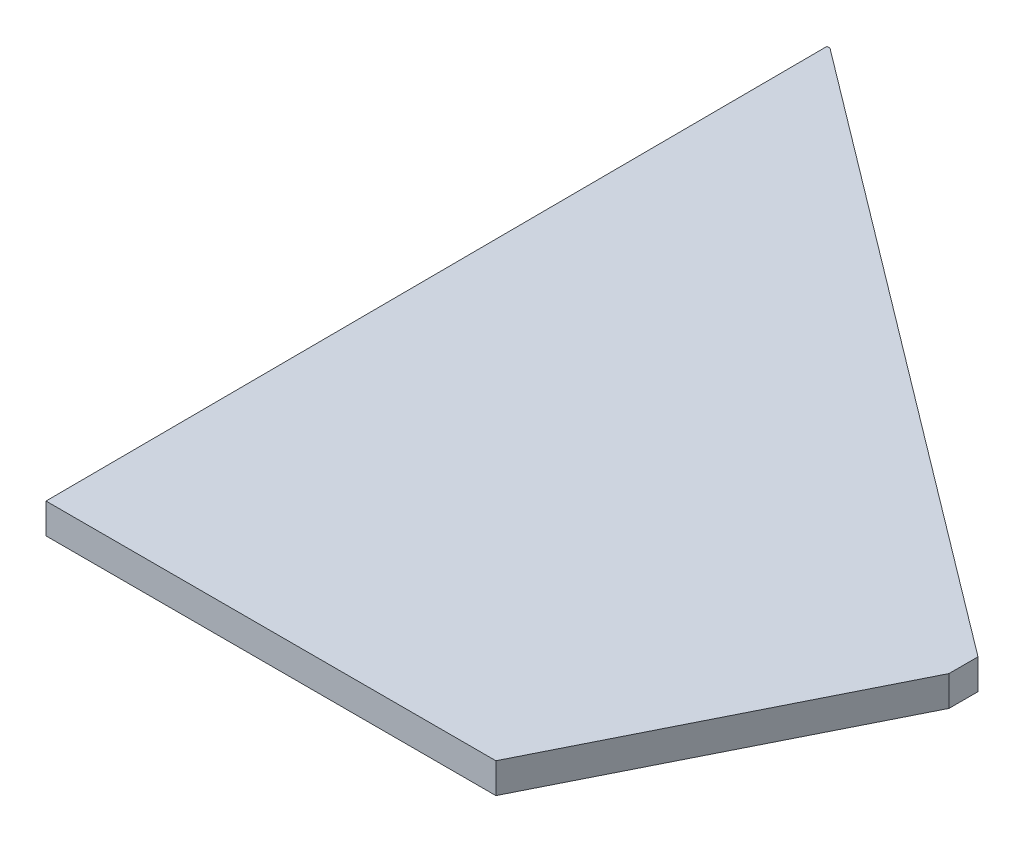
ISO-10303-21;
HEADER;
FILE_DESCRIPTION(('STEP AP214'),'2;1');
FILE_NAME('part.step','',(''),(''),'','','');
FILE_SCHEMA(('AUTOMOTIVE_DESIGN { 1 0 10303 214 1 1 1 1 }'));
ENDSEC;
DATA;
#1=APPLICATION_CONTEXT('core data for automotive mechanical design processes');
#2=APPLICATION_PROTOCOL_DEFINITION('international standard','automotive_design',2000,#1);
#3=PRODUCT_CONTEXT('',#1,'mechanical');
#4=PRODUCT('Part','Part','',(#3));
#5=PRODUCT_RELATED_PRODUCT_CATEGORY('part','',(#4));
#6=PRODUCT_DEFINITION_FORMATION('','',#4);
#7=PRODUCT_DEFINITION_CONTEXT('part definition',#1,'design');
#8=PRODUCT_DEFINITION('design','',#6,#7);
#9=PRODUCT_DEFINITION_SHAPE('','',#8);
#10=(LENGTH_UNIT() NAMED_UNIT(*) SI_UNIT(.MILLI.,.METRE.));
#11=(NAMED_UNIT(*) PLANE_ANGLE_UNIT() SI_UNIT($,.RADIAN.));
#12=(NAMED_UNIT(*) SI_UNIT($,.STERADIAN.) SOLID_ANGLE_UNIT());
#13=UNCERTAINTY_MEASURE_WITH_UNIT(LENGTH_MEASURE(1.E-05),#10,'distance_accuracy_value','');
#14=(GEOMETRIC_REPRESENTATION_CONTEXT(3) GLOBAL_UNCERTAINTY_ASSIGNED_CONTEXT((#13)) GLOBAL_UNIT_ASSIGNED_CONTEXT((#10,
#11,#12)) REPRESENTATION_CONTEXT('',''));
#15=CARTESIAN_POINT('',(0.,0.,0.));
#16=DIRECTION('',(0.,0.,1.));
#17=DIRECTION('',(1.,0.,0.));
#18=AXIS2_PLACEMENT_3D('',#15,#16,#17);
#19=CARTESIAN_POINT('',(29.7839893714207,2.,0.));
#20=DIRECTION('',(-0.894427190999916,0.,-0.447213595499957));
#21=DIRECTION('',(-0.447213595499957,0.,0.894427190999916));
#22=AXIS2_PLACEMENT_3D('',#19,#20,#21);
#23=PLANE('',#22);
#24=DIRECTION('',(0.447213595499957,0.,-0.894427190999916));
#25=VECTOR('',#24,1.);
#26=CARTESIAN_POINT('',(29.7839893714207,0.,0.));
#27=LINE('',#26,#25);
#28=CARTESIAN_POINT('',(29.7839893714207,0.,0.));
#29=VERTEX_POINT('',#28);
#30=CARTESIAN_POINT('',(39.7839893714206,0.,-20.));
#31=VERTEX_POINT('',#30);
#32=EDGE_CURVE('E128',#29,#31,#27,.T.);
#33=ORIENTED_EDGE('',*,*,#32,.T.);
#34=DIRECTION('',(0.,-1.,0.));
#35=VECTOR('',#34,1.);
#36=CARTESIAN_POINT('',(39.7839893714206,2.,-20.));
#37=LINE('',#36,#35);
#38=CARTESIAN_POINT('',(39.7839893714206,2.,-20.));
#39=VERTEX_POINT('',#38);
#40=EDGE_CURVE('E11',#39,#31,#37,.T.);
#41=ORIENTED_EDGE('',*,*,#40,.F.);
#42=DIRECTION('',(0.447213595499957,0.,-0.894427190999916));
#43=VECTOR('',#42,1.);
#44=CARTESIAN_POINT('',(29.7839893714207,2.,0.));
#45=LINE('',#44,#43);
#46=CARTESIAN_POINT('',(29.7839893714207,2.,0.));
#47=VERTEX_POINT('',#46);
#48=EDGE_CURVE('E144',#47,#39,#45,.T.);
#49=ORIENTED_EDGE('',*,*,#48,.F.);
#50=DIRECTION('',(0.,-1.,0.));
#51=VECTOR('',#50,1.);
#52=CARTESIAN_POINT('',(29.7839893714207,2.,0.));
#53=LINE('',#52,#51);
#54=EDGE_CURVE('E124',#47,#29,#53,.T.);
#55=ORIENTED_EDGE('',*,*,#54,.T.);
#56=EDGE_LOOP('',(#33,#41,#49,#55));
#57=FACE_BOUND('',#56,.T.);
#58=ADVANCED_FACE('F39',(#57),#23,.F.);
#59=CARTESIAN_POINT('',(39.7839893714206,2.,-20.));
#60=DIRECTION('',(-1.,0.,0.));
#61=DIRECTION('',(0.,0.,1.));
#62=AXIS2_PLACEMENT_3D('',#59,#60,#61);
#63=PLANE('',#62);
#64=DIRECTION('',(0.,0.,-1.));
#65=VECTOR('',#64,1.);
#66=CARTESIAN_POINT('',(39.7839893714206,0.,-20.));
#67=LINE('',#66,#65);
#68=CARTESIAN_POINT('',(39.7839893714206,0.,-21.9201252592534));
#69=VERTEX_POINT('',#68);
#70=EDGE_CURVE('E132',#31,#69,#67,.T.);
#71=ORIENTED_EDGE('',*,*,#70,.T.);
#72=DIRECTION('',(0.,-1.,0.));
#73=VECTOR('',#72,1.);
#74=CARTESIAN_POINT('',(39.7839893714206,2.,-21.9201252592534));
#75=LINE('',#74,#73);
#76=CARTESIAN_POINT('',(39.7839893714206,2.,-21.9201252592534));
#77=VERTEX_POINT('',#76);
#78=EDGE_CURVE('E48',#77,#69,#75,.T.);
#79=ORIENTED_EDGE('',*,*,#78,.F.);
#80=DIRECTION('',(0.,0.,-1.));
#81=VECTOR('',#80,1.);
#82=CARTESIAN_POINT('',(39.7839893714206,2.,-20.));
#83=LINE('',#82,#81);
#84=EDGE_CURVE('E93',#39,#77,#83,.T.);
#85=ORIENTED_EDGE('',*,*,#84,.F.);
#86=ORIENTED_EDGE('',*,*,#40,.T.);
#87=EDGE_LOOP('',(#71,#79,#85,#86));
#88=FACE_BOUND('',#87,.T.);
#89=ADVANCED_FACE('F172',(#88),#63,.F.);
#90=CARTESIAN_POINT('',(39.7839893714206,2.,-21.9201252592534));
#91=DIRECTION('',(-0.601924419035963,0.,0.798553062587715));
#92=DIRECTION('',(0.798553062587715,0.,0.601924419035963));
#93=AXIS2_PLACEMENT_3D('',#90,#91,#92);
#94=PLANE('',#93);
#95=DIRECTION('',(-0.798553062587715,0.,-0.601924419035963));
#96=VECTOR('',#95,1.);
#97=CARTESIAN_POINT('',(39.7839893714206,0.,-21.9201252592534));
#98=LINE('',#97,#96);
#99=CARTESIAN_POINT('',(-0.016010628579366,0.,-51.9201252592532));
#100=VERTEX_POINT('',#99);
#101=EDGE_CURVE('E135',#69,#100,#98,.T.);
#102=ORIENTED_EDGE('',*,*,#101,.T.);
#103=DIRECTION('',(0.,-1.,0.));
#104=VECTOR('',#103,1.);
#105=CARTESIAN_POINT('',(-0.016010628579366,2.,-51.9201252592532));
#106=LINE('',#105,#104);
#107=CARTESIAN_POINT('',(-0.016010628579366,2.,-51.9201252592532));
#108=VERTEX_POINT('',#107);
#109=EDGE_CURVE('E117',#108,#100,#106,.T.);
#110=ORIENTED_EDGE('',*,*,#109,.F.);
#111=DIRECTION('',(-0.798553062587715,0.,-0.601924419035963));
#112=VECTOR('',#111,1.);
#113=CARTESIAN_POINT('',(39.7839893714206,2.,-21.9201252592534));
#114=LINE('',#113,#112);
#115=EDGE_CURVE('E106',#77,#108,#114,.T.);
#116=ORIENTED_EDGE('',*,*,#115,.F.);
#117=ORIENTED_EDGE('',*,*,#78,.T.);
#118=EDGE_LOOP('',(#102,#110,#116,#117));
#119=FACE_BOUND('',#118,.T.);
#120=ADVANCED_FACE('F154',(#119),#94,.F.);
#121=CARTESIAN_POINT('',(-0.016010628579366,2.,-51.9201252592532));
#122=DIRECTION('',(0.,0.,1.));
#123=DIRECTION('',(1.,0.,0.));
#124=AXIS2_PLACEMENT_3D('',#121,#122,#123);
#125=PLANE('',#124);
#126=DIRECTION('',(-1.,0.,0.));
#127=VECTOR('',#126,1.);
#128=CARTESIAN_POINT('',(-0.016010628579366,0.,-51.9201252592532));
#129=LINE('',#128,#127);
#130=CARTESIAN_POINT('',(-0.216010628579344,0.,-51.9201252592532));
#131=VERTEX_POINT('',#130);
#132=EDGE_CURVE('E115',#100,#131,#129,.T.);
#133=ORIENTED_EDGE('',*,*,#132,.T.);
#134=DIRECTION('',(0.,-1.,0.));
#135=VECTOR('',#134,1.);
#136=CARTESIAN_POINT('',(-0.216010628579344,2.,-51.9201252592532));
#137=LINE('',#136,#135);
#138=CARTESIAN_POINT('',(-0.216010628579344,2.,-51.9201252592532));
#139=VERTEX_POINT('',#138);
#140=EDGE_CURVE('E112',#139,#131,#137,.T.);
#141=ORIENTED_EDGE('',*,*,#140,.F.);
#142=DIRECTION('',(-1.,0.,0.));
#143=VECTOR('',#142,1.);
#144=CARTESIAN_POINT('',(-0.016010628579366,2.,-51.9201252592532));
#145=LINE('',#144,#143);
#146=EDGE_CURVE('E100',#108,#139,#145,.T.);
#147=ORIENTED_EDGE('',*,*,#146,.F.);
#148=ORIENTED_EDGE('',*,*,#109,.T.);
#149=EDGE_LOOP('',(#133,#141,#147,#148));
#150=FACE_BOUND('',#149,.T.);
#151=ADVANCED_FACE('F113',(#150),#125,.F.);
#152=CARTESIAN_POINT('',(-0.216010628579344,2.,-51.9201252592532));
#153=DIRECTION('',(0.999991345476836,0.,-0.00416040519994428));
#154=DIRECTION('',(-0.00416040519994428,0.,-0.999991345476836));
#155=AXIS2_PLACEMENT_3D('',#152,#153,#154);
#156=PLANE('',#155);
#157=DIRECTION('',(0.00416040519994428,0.,0.999991345476836));
#158=VECTOR('',#157,1.);
#159=CARTESIAN_POINT('',(-0.216010628579344,0.,-51.9201252592532));
#160=LINE('',#159,#158);
#161=CARTESIAN_POINT('',(0.,0.,0.));
#162=VERTEX_POINT('',#161);
#163=EDGE_CURVE('E79',#131,#162,#160,.T.);
#164=ORIENTED_EDGE('',*,*,#163,.T.);
#165=DIRECTION('',(0.,-1.,0.));
#166=VECTOR('',#165,1.);
#167=CARTESIAN_POINT('',(0.,2.,0.));
#168=LINE('',#167,#166);
#169=CARTESIAN_POINT('',(0.,2.,0.));
#170=VERTEX_POINT('',#169);
#171=EDGE_CURVE('E118',#170,#162,#168,.T.);
#172=ORIENTED_EDGE('',*,*,#171,.F.);
#173=DIRECTION('',(0.00416040519994428,0.,0.999991345476836));
#174=VECTOR('',#173,1.);
#175=CARTESIAN_POINT('',(-0.216010628579344,2.,-51.9201252592532));
#176=LINE('',#175,#174);
#177=EDGE_CURVE('E104',#139,#170,#176,.T.);
#178=ORIENTED_EDGE('',*,*,#177,.F.);
#179=ORIENTED_EDGE('',*,*,#140,.T.);
#180=EDGE_LOOP('',(#164,#172,#178,#179));
#181=FACE_BOUND('',#180,.T.);
#182=ADVANCED_FACE('F120',(#181),#156,.F.);
#183=CARTESIAN_POINT('',(0.,2.,0.));
#184=DIRECTION('',(0.,0.,-1.));
#185=DIRECTION('',(-1.,0.,0.));
#186=AXIS2_PLACEMENT_3D('',#183,#184,#185);
#187=PLANE('',#186);
#188=DIRECTION('',(1.,0.,0.));
#189=VECTOR('',#188,1.);
#190=CARTESIAN_POINT('',(0.,0.,0.));
#191=LINE('',#190,#189);
#192=EDGE_CURVE('E85',#162,#29,#191,.T.);
#193=ORIENTED_EDGE('',*,*,#192,.T.);
#194=ORIENTED_EDGE('',*,*,#54,.F.);
#195=DIRECTION('',(1.,0.,0.));
#196=VECTOR('',#195,1.);
#197=CARTESIAN_POINT('',(0.,2.,0.));
#198=LINE('',#197,#196);
#199=EDGE_CURVE('E56',#170,#47,#198,.T.);
#200=ORIENTED_EDGE('',*,*,#199,.F.);
#201=ORIENTED_EDGE('',*,*,#171,.T.);
#202=EDGE_LOOP('',(#193,#194,#200,#201));
#203=FACE_BOUND('',#202,.T.);
#204=ADVANCED_FACE('F161',(#203),#187,.F.);
#205=CARTESIAN_POINT('',(0.,2.,0.));
#206=DIRECTION('',(0.,1.,0.));
#207=DIRECTION('',(0.,0.,1.));
#208=AXIS2_PLACEMENT_3D('',#205,#206,#207);
#209=PLANE('',#208);
#210=ORIENTED_EDGE('',*,*,#48,.T.);
#211=ORIENTED_EDGE('',*,*,#84,.T.);
#212=ORIENTED_EDGE('',*,*,#115,.T.);
#213=ORIENTED_EDGE('',*,*,#146,.T.);
#214=ORIENTED_EDGE('',*,*,#177,.T.);
#215=ORIENTED_EDGE('',*,*,#199,.T.);
#216=EDGE_LOOP('',(#210,#211,#212,#213,#214,#215));
#217=FACE_BOUND('',#216,.T.);
#218=ADVANCED_FACE('F102',(#217),#209,.T.);
#219=CARTESIAN_POINT('',(0.,0.,0.));
#220=DIRECTION('',(0.,1.,0.));
#221=DIRECTION('',(0.,0.,1.));
#222=AXIS2_PLACEMENT_3D('',#219,#220,#221);
#223=PLANE('',#222);
#224=ORIENTED_EDGE('',*,*,#32,.F.);
#225=ORIENTED_EDGE('',*,*,#192,.F.);
#226=ORIENTED_EDGE('',*,*,#163,.F.);
#227=ORIENTED_EDGE('',*,*,#132,.F.);
#228=ORIENTED_EDGE('',*,*,#101,.F.);
#229=ORIENTED_EDGE('',*,*,#70,.F.);
#230=EDGE_LOOP('',(#224,#225,#226,#227,#228,#229));
#231=FACE_BOUND('',#230,.T.);
#232=ADVANCED_FACE('F157',(#231),#223,.F.);
#233=CLOSED_SHELL('',(#58,#89,#120,#151,#182,#204,#218,#232));
#234=MANIFOLD_SOLID_BREP('B2',#233);
#235=ADVANCED_BREP_SHAPE_REPRESENTATION('',(#18,#234),#14);
#236=SHAPE_DEFINITION_REPRESENTATION(#9,#235);
ENDSEC;
END-ISO-10303-21;
